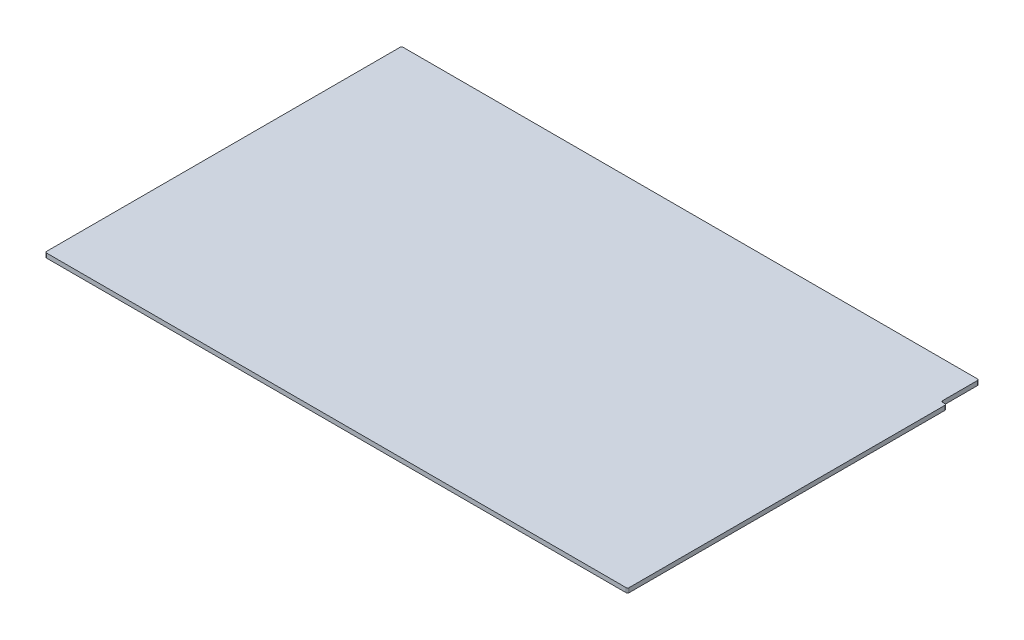
ISO-10303-21;
HEADER;
FILE_DESCRIPTION(('STEP AP214'),'2;1');
FILE_NAME('part.step','',(''),(''),'','','');
FILE_SCHEMA(('AUTOMOTIVE_DESIGN { 1 0 10303 214 1 1 1 1 }'));
ENDSEC;
DATA;
#1=APPLICATION_CONTEXT('core data for automotive mechanical design processes');
#2=APPLICATION_PROTOCOL_DEFINITION('international standard','automotive_design',2000,#1);
#3=PRODUCT_CONTEXT('',#1,'mechanical');
#4=PRODUCT('Part','Part','',(#3));
#5=PRODUCT_RELATED_PRODUCT_CATEGORY('part','',(#4));
#6=PRODUCT_DEFINITION_FORMATION('','',#4);
#7=PRODUCT_DEFINITION_CONTEXT('part definition',#1,'design');
#8=PRODUCT_DEFINITION('design','',#6,#7);
#9=PRODUCT_DEFINITION_SHAPE('','',#8);
#10=(LENGTH_UNIT() NAMED_UNIT(*) SI_UNIT(.MILLI.,.METRE.));
#11=(NAMED_UNIT(*) PLANE_ANGLE_UNIT() SI_UNIT($,.RADIAN.));
#12=(NAMED_UNIT(*) SI_UNIT($,.STERADIAN.) SOLID_ANGLE_UNIT());
#13=UNCERTAINTY_MEASURE_WITH_UNIT(LENGTH_MEASURE(1.E-05),#10,'distance_accuracy_value','');
#14=(GEOMETRIC_REPRESENTATION_CONTEXT(3) GLOBAL_UNCERTAINTY_ASSIGNED_CONTEXT((#13)) GLOBAL_UNIT_ASSIGNED_CONTEXT((#10,
#11,#12)) REPRESENTATION_CONTEXT('',''));
#15=CARTESIAN_POINT('',(0.,0.,0.));
#16=DIRECTION('',(0.,0.,1.));
#17=DIRECTION('',(1.,0.,0.));
#18=AXIS2_PLACEMENT_3D('',#15,#16,#17);
#19=CARTESIAN_POINT('',(156.8958,-1.1938,0.));
#20=DIRECTION('',(0.,0.,1.));
#21=DIRECTION('',(1.,0.,0.));
#22=AXIS2_PLACEMENT_3D('',#19,#20,#21);
#23=PLANE('',#22);
#24=DIRECTION('',(1.,0.,0.));
#25=VECTOR('',#24,1.);
#26=CARTESIAN_POINT('',(156.8958,-1.1938,0.));
#27=LINE('',#26,#25);
#28=CARTESIAN_POINT('',(0.396874999999991,-1.1938,0.));
#29=VERTEX_POINT('',#28);
#30=CARTESIAN_POINT('',(156.498925,-1.1938,0.));
#31=VERTEX_POINT('',#30);
#32=EDGE_CURVE('E230',#29,#31,#27,.T.);
#33=ORIENTED_EDGE('',*,*,#32,.T.);
#34=DIRECTION('',(0.,1.,0.));
#35=VECTOR('',#34,1.);
#36=CARTESIAN_POINT('',(156.498925,-1.1938,0.));
#37=LINE('',#36,#35);
#38=CARTESIAN_POINT('',(156.498925,0.,0.));
#39=VERTEX_POINT('',#38);
#40=EDGE_CURVE('E146',#31,#39,#37,.T.);
#41=ORIENTED_EDGE('',*,*,#40,.T.);
#42=DIRECTION('',(1.,0.,0.));
#43=VECTOR('',#42,1.);
#44=CARTESIAN_POINT('',(156.8958,0.,0.));
#45=LINE('',#44,#43);
#46=CARTESIAN_POINT('',(0.396874999999991,0.,0.));
#47=VERTEX_POINT('',#46);
#48=EDGE_CURVE('E138',#47,#39,#45,.T.);
#49=ORIENTED_EDGE('',*,*,#48,.F.);
#50=DIRECTION('',(0.,1.,0.));
#51=VECTOR('',#50,1.);
#52=CARTESIAN_POINT('',(0.396874999999991,-1.1938,0.));
#53=LINE('',#52,#51);
#54=EDGE_CURVE('E151',#47,#29,#53,.F.);
#55=ORIENTED_EDGE('',*,*,#54,.T.);
#56=EDGE_LOOP('',(#33,#41,#49,#55));
#57=FACE_BOUND('',#56,.T.);
#58=ADVANCED_FACE('F45',(#57),#23,.T.);
#59=CARTESIAN_POINT('',(0.,-1.1938,0.));
#60=DIRECTION('',(-1.,0.,0.));
#61=DIRECTION('',(0.,0.,1.));
#62=AXIS2_PLACEMENT_3D('',#59,#60,#61);
#63=PLANE('',#62);
#64=DIRECTION('',(0.,0.,1.));
#65=VECTOR('',#64,1.);
#66=CARTESIAN_POINT('',(0.,0.,0.));
#67=LINE('',#66,#65);
#68=CARTESIAN_POINT('',(0.,0.,-95.615125));
#69=VERTEX_POINT('',#68);
#70=CARTESIAN_POINT('',(0.,0.,-0.396875));
#71=VERTEX_POINT('',#70);
#72=EDGE_CURVE('E140',#69,#71,#67,.T.);
#73=ORIENTED_EDGE('',*,*,#72,.F.);
#74=DIRECTION('',(0.,1.,0.));
#75=VECTOR('',#74,1.);
#76=CARTESIAN_POINT('',(0.,-1.1938,-95.615125));
#77=LINE('',#76,#75);
#78=CARTESIAN_POINT('',(0.,-1.1938,-95.615125));
#79=VERTEX_POINT('',#78);
#80=EDGE_CURVE('E204',#69,#79,#77,.F.);
#81=ORIENTED_EDGE('',*,*,#80,.T.);
#82=DIRECTION('',(0.,0.,1.));
#83=VECTOR('',#82,1.);
#84=CARTESIAN_POINT('',(0.,-1.1938,0.));
#85=LINE('',#84,#83);
#86=CARTESIAN_POINT('',(0.,-1.1938,-0.396875));
#87=VERTEX_POINT('',#86);
#88=EDGE_CURVE('E159',#79,#87,#85,.T.);
#89=ORIENTED_EDGE('',*,*,#88,.T.);
#90=DIRECTION('',(0.,1.,0.));
#91=VECTOR('',#90,1.);
#92=CARTESIAN_POINT('',(0.,-1.1938,-0.396875));
#93=LINE('',#92,#91);
#94=EDGE_CURVE('E202',#87,#71,#93,.T.);
#95=ORIENTED_EDGE('',*,*,#94,.T.);
#96=EDGE_LOOP('',(#73,#81,#89,#95));
#97=FACE_BOUND('',#96,.T.);
#98=ADVANCED_FACE('F258',(#97),#63,.T.);
#99=CARTESIAN_POINT('',(0.,-1.1938,-96.012));
#100=DIRECTION('',(0.,0.,-1.));
#101=DIRECTION('',(-1.,0.,0.));
#102=AXIS2_PLACEMENT_3D('',#99,#100,#101);
#103=PLANE('',#102);
#104=DIRECTION('',(-1.,0.,0.));
#105=VECTOR('',#104,1.);
#106=CARTESIAN_POINT('',(0.,0.,-96.012));
#107=LINE('',#106,#105);
#108=CARTESIAN_POINT('',(155.101925,0.,-96.012));
#109=VERTEX_POINT('',#108);
#110=CARTESIAN_POINT('',(0.396875,0.,-96.012));
#111=VERTEX_POINT('',#110);
#112=EDGE_CURVE('E238',#109,#111,#107,.T.);
#113=ORIENTED_EDGE('',*,*,#112,.F.);
#114=DIRECTION('',(0.,1.,0.));
#115=VECTOR('',#114,1.);
#116=CARTESIAN_POINT('',(155.101925,-1.1938,-96.012));
#117=LINE('',#116,#115);
#118=CARTESIAN_POINT('',(155.101925,-1.1938,-96.012));
#119=VERTEX_POINT('',#118);
#120=EDGE_CURVE('E200',#109,#119,#117,.F.);
#121=ORIENTED_EDGE('',*,*,#120,.T.);
#122=DIRECTION('',(-1.,0.,0.));
#123=VECTOR('',#122,1.);
#124=CARTESIAN_POINT('',(0.,-1.1938,-96.012));
#125=LINE('',#124,#123);
#126=CARTESIAN_POINT('',(0.396875,-1.1938,-96.012));
#127=VERTEX_POINT('',#126);
#128=EDGE_CURVE('E163',#119,#127,#125,.T.);
#129=ORIENTED_EDGE('',*,*,#128,.T.);
#130=DIRECTION('',(0.,1.,0.));
#131=VECTOR('',#130,1.);
#132=CARTESIAN_POINT('',(0.396875,-1.1938,-96.012));
#133=LINE('',#132,#131);
#134=EDGE_CURVE('E197',#127,#111,#133,.T.);
#135=ORIENTED_EDGE('',*,*,#134,.T.);
#136=EDGE_LOOP('',(#113,#121,#129,#135));
#137=FACE_BOUND('',#136,.T.);
#138=ADVANCED_FACE('F243',(#137),#103,.T.);
#139=CARTESIAN_POINT('',(156.8958,-1.1938,-96.012));
#140=DIRECTION('',(1.,0.,0.));
#141=DIRECTION('',(0.,0.,-1.));
#142=AXIS2_PLACEMENT_3D('',#139,#140,#141);
#143=PLANE('',#142);
#144=DIRECTION('',(0.,0.,-1.));
#145=VECTOR('',#144,1.);
#146=CARTESIAN_POINT('',(156.8958,0.,-96.012));
#147=LINE('',#146,#145);
#148=CARTESIAN_POINT('',(156.8958,0.,-0.396875000000005));
#149=VERTEX_POINT('',#148);
#150=CARTESIAN_POINT('',(156.8958,0.,-85.455125));
#151=VERTEX_POINT('',#150);
#152=EDGE_CURVE('E154',#149,#151,#147,.T.);
#153=ORIENTED_EDGE('',*,*,#152,.F.);
#154=DIRECTION('',(0.,1.,0.));
#155=VECTOR('',#154,1.);
#156=CARTESIAN_POINT('',(156.8958,-1.1938,-0.396875000000005));
#157=LINE('',#156,#155);
#158=CARTESIAN_POINT('',(156.8958,-1.1938,-0.396875000000005));
#159=VERTEX_POINT('',#158);
#160=EDGE_CURVE('E178',#149,#159,#157,.F.);
#161=ORIENTED_EDGE('',*,*,#160,.T.);
#162=DIRECTION('',(0.,0.,-1.));
#163=VECTOR('',#162,1.);
#164=CARTESIAN_POINT('',(156.8958,-1.1938,-96.012));
#165=LINE('',#164,#163);
#166=CARTESIAN_POINT('',(156.8958,-1.1938,-85.455125));
#167=VERTEX_POINT('',#166);
#168=EDGE_CURVE('E232',#159,#167,#165,.T.);
#169=ORIENTED_EDGE('',*,*,#168,.T.);
#170=DIRECTION('',(0.,1.,0.));
#171=VECTOR('',#170,1.);
#172=CARTESIAN_POINT('',(156.8958,0.,-85.455125));
#173=LINE('',#172,#171);
#174=EDGE_CURVE('E175',#167,#151,#173,.T.);
#175=ORIENTED_EDGE('',*,*,#174,.T.);
#176=EDGE_LOOP('',(#153,#161,#169,#175));
#177=FACE_BOUND('',#176,.T.);
#178=ADVANCED_FACE('F267',(#177),#143,.T.);
#179=CARTESIAN_POINT('',(0.,-1.1938,0.));
#180=DIRECTION('',(0.,-1.,0.));
#181=DIRECTION('',(0.,0.,-1.));
#182=AXIS2_PLACEMENT_3D('',#179,#180,#181);
#183=PLANE('',#182);
#184=ORIENTED_EDGE('',*,*,#168,.F.);
#185=CARTESIAN_POINT('',(156.498925,-1.1938,-0.396875));
#186=DIRECTION('',(0.,-1.,0.));
#187=DIRECTION('',(0.,0.,-1.));
#188=AXIS2_PLACEMENT_3D('',#185,#186,#187);
#189=CIRCLE('',#188,0.396875);
#190=EDGE_CURVE('E186',#159,#31,#189,.T.);
#191=ORIENTED_EDGE('',*,*,#190,.T.);
#192=ORIENTED_EDGE('',*,*,#32,.F.);
#193=CARTESIAN_POINT('',(0.396875,-1.1938,-0.396875));
#194=DIRECTION('',(0.,-1.,0.));
#195=DIRECTION('',(0.,0.,-1.));
#196=AXIS2_PLACEMENT_3D('',#193,#194,#195);
#197=CIRCLE('',#196,0.396875);
#198=EDGE_CURVE('E158',#29,#87,#197,.T.);
#199=ORIENTED_EDGE('',*,*,#198,.T.);
#200=ORIENTED_EDGE('',*,*,#88,.F.);
#201=CARTESIAN_POINT('',(0.396875,-1.1938,-95.615125));
#202=DIRECTION('',(0.,-1.,0.));
#203=DIRECTION('',(0.,0.,-1.));
#204=AXIS2_PLACEMENT_3D('',#201,#202,#203);
#205=CIRCLE('',#204,0.396875);
#206=EDGE_CURVE('E181',#79,#127,#205,.T.);
#207=ORIENTED_EDGE('',*,*,#206,.T.);
#208=ORIENTED_EDGE('',*,*,#128,.F.);
#209=CARTESIAN_POINT('',(155.101925,-1.1938,-95.615125));
#210=DIRECTION('',(0.,-1.,0.));
#211=DIRECTION('',(0.,0.,-1.));
#212=AXIS2_PLACEMENT_3D('',#209,#210,#211);
#213=CIRCLE('',#212,0.396875);
#214=CARTESIAN_POINT('',(155.4988,-1.1938,-95.615125));
#215=VERTEX_POINT('',#214);
#216=EDGE_CURVE('E67',#119,#215,#213,.T.);
#217=ORIENTED_EDGE('',*,*,#216,.T.);
#218=DIRECTION('',(0.,0.,1.));
#219=VECTOR('',#218,1.);
#220=CARTESIAN_POINT('',(155.4988,-1.1938,-96.012));
#221=LINE('',#220,#219);
#222=CARTESIAN_POINT('',(155.4988,-1.1938,-86.248875));
#223=VERTEX_POINT('',#222);
#224=EDGE_CURVE('E222',#215,#223,#221,.T.);
#225=ORIENTED_EDGE('',*,*,#224,.T.);
#226=CARTESIAN_POINT('',(155.895675,-1.1938,-86.248875));
#227=DIRECTION('',(0.,-1.,0.));
#228=DIRECTION('',(0.,0.,-1.));
#229=AXIS2_PLACEMENT_3D('',#226,#227,#228);
#230=CIRCLE('',#229,0.396875);
#231=CARTESIAN_POINT('',(155.895675,-1.1938,-85.852));
#232=VERTEX_POINT('',#231);
#233=EDGE_CURVE('E11',#223,#232,#230,.F.);
#234=ORIENTED_EDGE('',*,*,#233,.T.);
#235=DIRECTION('',(1.,0.,0.));
#236=VECTOR('',#235,1.);
#237=CARTESIAN_POINT('',(156.8958,-1.1938,-85.852));
#238=LINE('',#237,#236);
#239=CARTESIAN_POINT('',(156.498925,-1.1938,-85.852));
#240=VERTEX_POINT('',#239);
#241=EDGE_CURVE('E155',#232,#240,#238,.T.);
#242=ORIENTED_EDGE('',*,*,#241,.T.);
#243=CARTESIAN_POINT('',(156.498925,-1.1938,-85.455125));
#244=DIRECTION('',(0.,-1.,0.));
#245=DIRECTION('',(0.,0.,-1.));
#246=AXIS2_PLACEMENT_3D('',#243,#244,#245);
#247=CIRCLE('',#246,0.396875);
#248=EDGE_CURVE('E184',#240,#167,#247,.T.);
#249=ORIENTED_EDGE('',*,*,#248,.T.);
#250=EDGE_LOOP('',(#184,#191,#192,#199,#200,#207,#208,#217,#225,#234,#242,#249));
#251=FACE_BOUND('',#250,.T.);
#252=ADVANCED_FACE('F220',(#251),#183,.T.);
#253=CARTESIAN_POINT('',(0.,0.,0.));
#254=DIRECTION('',(0.,-1.,0.));
#255=DIRECTION('',(0.,0.,-1.));
#256=AXIS2_PLACEMENT_3D('',#253,#254,#255);
#257=PLANE('',#256);
#258=ORIENTED_EDGE('',*,*,#48,.T.);
#259=CARTESIAN_POINT('',(156.498925,0.,-0.396875));
#260=DIRECTION('',(0.,-1.,0.));
#261=DIRECTION('',(0.,0.,-1.));
#262=AXIS2_PLACEMENT_3D('',#259,#260,#261);
#263=CIRCLE('',#262,0.396875);
#264=EDGE_CURVE('E173',#39,#149,#263,.F.);
#265=ORIENTED_EDGE('',*,*,#264,.T.);
#266=ORIENTED_EDGE('',*,*,#152,.T.);
#267=CARTESIAN_POINT('',(156.498925,0.,-85.455125));
#268=DIRECTION('',(0.,-1.,0.));
#269=DIRECTION('',(0.,0.,-1.));
#270=AXIS2_PLACEMENT_3D('',#267,#268,#269);
#271=CIRCLE('',#270,0.396875);
#272=CARTESIAN_POINT('',(156.498925,0.,-85.852));
#273=VERTEX_POINT('',#272);
#274=EDGE_CURVE('E171',#151,#273,#271,.F.);
#275=ORIENTED_EDGE('',*,*,#274,.T.);
#276=DIRECTION('',(1.,0.,0.));
#277=VECTOR('',#276,1.);
#278=CARTESIAN_POINT('',(156.8958,0.,-85.852));
#279=LINE('',#278,#277);
#280=CARTESIAN_POINT('',(155.895675,0.,-85.852));
#281=VERTEX_POINT('',#280);
#282=EDGE_CURVE('E209',#281,#273,#279,.T.);
#283=ORIENTED_EDGE('',*,*,#282,.F.);
#284=CARTESIAN_POINT('',(155.895675,0.,-86.248875));
#285=DIRECTION('',(0.,-1.,0.));
#286=DIRECTION('',(0.,0.,-1.));
#287=AXIS2_PLACEMENT_3D('',#284,#285,#286);
#288=CIRCLE('',#287,0.396875);
#289=CARTESIAN_POINT('',(155.4988,0.,-86.248875));
#290=VERTEX_POINT('',#289);
#291=EDGE_CURVE('E53',#281,#290,#288,.T.);
#292=ORIENTED_EDGE('',*,*,#291,.T.);
#293=DIRECTION('',(0.,0.,1.));
#294=VECTOR('',#293,1.);
#295=CARTESIAN_POINT('',(155.4988,0.,-96.012));
#296=LINE('',#295,#294);
#297=CARTESIAN_POINT('',(155.4988,0.,-95.615125));
#298=VERTEX_POINT('',#297);
#299=EDGE_CURVE('E207',#298,#290,#296,.T.);
#300=ORIENTED_EDGE('',*,*,#299,.F.);
#301=CARTESIAN_POINT('',(155.101925,0.,-95.615125));
#302=DIRECTION('',(0.,-1.,0.));
#303=DIRECTION('',(0.,0.,-1.));
#304=AXIS2_PLACEMENT_3D('',#301,#302,#303);
#305=CIRCLE('',#304,0.396875);
#306=EDGE_CURVE('E169',#298,#109,#305,.F.);
#307=ORIENTED_EDGE('',*,*,#306,.T.);
#308=ORIENTED_EDGE('',*,*,#112,.T.);
#309=CARTESIAN_POINT('',(0.396875,0.,-95.615125));
#310=DIRECTION('',(0.,-1.,0.));
#311=DIRECTION('',(0.,0.,-1.));
#312=AXIS2_PLACEMENT_3D('',#309,#310,#311);
#313=CIRCLE('',#312,0.396875);
#314=EDGE_CURVE('E145',#111,#69,#313,.F.);
#315=ORIENTED_EDGE('',*,*,#314,.T.);
#316=ORIENTED_EDGE('',*,*,#72,.T.);
#317=CARTESIAN_POINT('',(0.396875,0.,-0.396875));
#318=DIRECTION('',(0.,-1.,0.));
#319=DIRECTION('',(0.,0.,-1.));
#320=AXIS2_PLACEMENT_3D('',#317,#318,#319);
#321=CIRCLE('',#320,0.396875);
#322=EDGE_CURVE('E135',#71,#47,#321,.F.);
#323=ORIENTED_EDGE('',*,*,#322,.T.);
#324=EDGE_LOOP('',(#258,#265,#266,#275,#283,#292,#300,#307,#308,#315,#316,#323));
#325=FACE_BOUND('',#324,.T.);
#326=ADVANCED_FACE('F137',(#325),#257,.F.);
#327=CARTESIAN_POINT('',(156.8958,-1.1938,-85.852));
#328=DIRECTION('',(0.,0.,1.));
#329=DIRECTION('',(1.,0.,0.));
#330=AXIS2_PLACEMENT_3D('',#327,#328,#329);
#331=PLANE('',#330);
#332=ORIENTED_EDGE('',*,*,#282,.T.);
#333=DIRECTION('',(0.,1.,0.));
#334=VECTOR('',#333,1.);
#335=CARTESIAN_POINT('',(156.498925,-1.1938,-85.852));
#336=LINE('',#335,#334);
#337=EDGE_CURVE('E191',#273,#240,#336,.F.);
#338=ORIENTED_EDGE('',*,*,#337,.T.);
#339=ORIENTED_EDGE('',*,*,#241,.F.);
#340=DIRECTION('',(0.,1.,0.));
#341=VECTOR('',#340,1.);
#342=CARTESIAN_POINT('',(155.895675,0.,-85.852));
#343=LINE('',#342,#341);
#344=EDGE_CURVE('E188',#232,#281,#343,.T.);
#345=ORIENTED_EDGE('',*,*,#344,.T.);
#346=EDGE_LOOP('',(#332,#338,#339,#345));
#347=FACE_BOUND('',#346,.T.);
#348=ADVANCED_FACE('F224',(#347),#331,.F.);
#349=CARTESIAN_POINT('',(155.4988,-1.1938,-96.012));
#350=DIRECTION('',(-1.,0.,0.));
#351=DIRECTION('',(0.,0.,1.));
#352=AXIS2_PLACEMENT_3D('',#349,#350,#351);
#353=PLANE('',#352);
#354=ORIENTED_EDGE('',*,*,#299,.T.);
#355=DIRECTION('',(0.,1.,0.));
#356=VECTOR('',#355,1.);
#357=CARTESIAN_POINT('',(155.4988,-1.1938,-86.248875));
#358=LINE('',#357,#356);
#359=EDGE_CURVE('E60',#290,#223,#358,.F.);
#360=ORIENTED_EDGE('',*,*,#359,.T.);
#361=ORIENTED_EDGE('',*,*,#224,.F.);
#362=DIRECTION('',(0.,1.,0.));
#363=VECTOR('',#362,1.);
#364=CARTESIAN_POINT('',(155.4988,0.,-95.615125));
#365=LINE('',#364,#363);
#366=EDGE_CURVE('E193',#215,#298,#365,.T.);
#367=ORIENTED_EDGE('',*,*,#366,.T.);
#368=EDGE_LOOP('',(#354,#360,#361,#367));
#369=FACE_BOUND('',#368,.T.);
#370=ADVANCED_FACE('F212',(#369),#353,.F.);
#371=CARTESIAN_POINT('',(156.498925,-1.1938,-0.396875));
#372=DIRECTION('',(0.,1.,0.));
#373=DIRECTION('',(0.,0.,1.));
#374=AXIS2_PLACEMENT_3D('',#371,#372,#373);
#375=CYLINDRICAL_SURFACE('',#374,0.396875);
#376=ORIENTED_EDGE('',*,*,#190,.F.);
#377=ORIENTED_EDGE('',*,*,#160,.F.);
#378=ORIENTED_EDGE('',*,*,#264,.F.);
#379=ORIENTED_EDGE('',*,*,#40,.F.);
#380=EDGE_LOOP('',(#376,#377,#378,#379));
#381=FACE_BOUND('',#380,.T.);
#382=ADVANCED_FACE('F269',(#381),#375,.T.);
#383=CARTESIAN_POINT('',(156.498925,-1.1938,-85.455125));
#384=DIRECTION('',(0.,-1.,0.));
#385=DIRECTION('',(0.,0.,-1.));
#386=AXIS2_PLACEMENT_3D('',#383,#384,#385);
#387=CYLINDRICAL_SURFACE('',#386,0.396875);
#388=ORIENTED_EDGE('',*,*,#248,.F.);
#389=ORIENTED_EDGE('',*,*,#337,.F.);
#390=ORIENTED_EDGE('',*,*,#274,.F.);
#391=ORIENTED_EDGE('',*,*,#174,.F.);
#392=EDGE_LOOP('',(#388,#389,#390,#391));
#393=FACE_BOUND('',#392,.T.);
#394=ADVANCED_FACE('F255',(#393),#387,.T.);
#395=CARTESIAN_POINT('',(155.895675,-1.1938,-86.248875));
#396=DIRECTION('',(0.,-1.,0.));
#397=DIRECTION('',(0.,0.,-1.));
#398=AXIS2_PLACEMENT_3D('',#395,#396,#397);
#399=CYLINDRICAL_SURFACE('',#398,0.396875);
#400=ORIENTED_EDGE('',*,*,#233,.F.);
#401=ORIENTED_EDGE('',*,*,#359,.F.);
#402=ORIENTED_EDGE('',*,*,#291,.F.);
#403=ORIENTED_EDGE('',*,*,#344,.F.);
#404=EDGE_LOOP('',(#400,#401,#402,#403));
#405=FACE_BOUND('',#404,.T.);
#406=ADVANCED_FACE('F216',(#405),#399,.F.);
#407=CARTESIAN_POINT('',(155.101925,-1.1938,-95.615125));
#408=DIRECTION('',(0.,-1.,0.));
#409=DIRECTION('',(0.,0.,-1.));
#410=AXIS2_PLACEMENT_3D('',#407,#408,#409);
#411=CYLINDRICAL_SURFACE('',#410,0.396875);
#412=ORIENTED_EDGE('',*,*,#216,.F.);
#413=ORIENTED_EDGE('',*,*,#120,.F.);
#414=ORIENTED_EDGE('',*,*,#306,.F.);
#415=ORIENTED_EDGE('',*,*,#366,.F.);
#416=EDGE_LOOP('',(#412,#413,#414,#415));
#417=FACE_BOUND('',#416,.T.);
#418=ADVANCED_FACE('F246',(#417),#411,.T.);
#419=CARTESIAN_POINT('',(0.396875,-1.1938,-95.615125));
#420=DIRECTION('',(0.,1.,0.));
#421=DIRECTION('',(0.,0.,1.));
#422=AXIS2_PLACEMENT_3D('',#419,#420,#421);
#423=CYLINDRICAL_SURFACE('',#422,0.396875);
#424=ORIENTED_EDGE('',*,*,#206,.F.);
#425=ORIENTED_EDGE('',*,*,#80,.F.);
#426=ORIENTED_EDGE('',*,*,#314,.F.);
#427=ORIENTED_EDGE('',*,*,#134,.F.);
#428=EDGE_LOOP('',(#424,#425,#426,#427));
#429=FACE_BOUND('',#428,.T.);
#430=ADVANCED_FACE('F248',(#429),#423,.T.);
#431=CARTESIAN_POINT('',(0.396875,-1.1938,-0.396875));
#432=DIRECTION('',(0.,1.,0.));
#433=DIRECTION('',(0.,0.,1.));
#434=AXIS2_PLACEMENT_3D('',#431,#432,#433);
#435=CYLINDRICAL_SURFACE('',#434,0.396875);
#436=ORIENTED_EDGE('',*,*,#198,.F.);
#437=ORIENTED_EDGE('',*,*,#54,.F.);
#438=ORIENTED_EDGE('',*,*,#322,.F.);
#439=ORIENTED_EDGE('',*,*,#94,.F.);
#440=EDGE_LOOP('',(#436,#437,#438,#439));
#441=FACE_BOUND('',#440,.T.);
#442=ADVANCED_FACE('F47',(#441),#435,.T.);
#443=CLOSED_SHELL('',(#58,#98,#138,#178,#252,#326,#348,#370,#382,#394,#406,#418,#430,#442));
#444=MANIFOLD_SOLID_BREP('B2',#443);
#445=ADVANCED_BREP_SHAPE_REPRESENTATION('',(#18,#444),#14);
#446=SHAPE_DEFINITION_REPRESENTATION(#9,#445);
ENDSEC;
END-ISO-10303-21;
